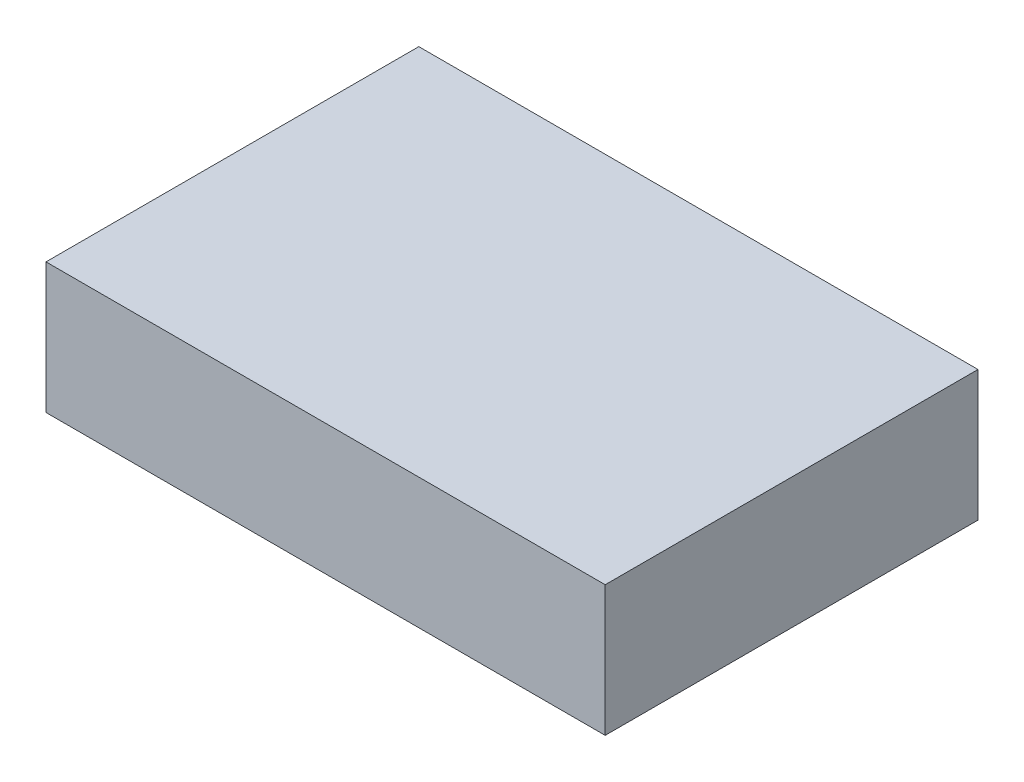
ISO-10303-21;
HEADER;
FILE_DESCRIPTION(('STEP AP214'),'2;1');
FILE_NAME('part.step','',(''),(''),'','','');
FILE_SCHEMA(('AUTOMOTIVE_DESIGN { 1 0 10303 214 1 1 1 1 }'));
ENDSEC;
DATA;
#1=APPLICATION_CONTEXT('core data for automotive mechanical design processes');
#2=APPLICATION_PROTOCOL_DEFINITION('international standard','automotive_design',2000,#1);
#3=PRODUCT_CONTEXT('',#1,'mechanical');
#4=PRODUCT('Part','Part','',(#3));
#5=PRODUCT_RELATED_PRODUCT_CATEGORY('part','',(#4));
#6=PRODUCT_DEFINITION_FORMATION('','',#4);
#7=PRODUCT_DEFINITION_CONTEXT('part definition',#1,'design');
#8=PRODUCT_DEFINITION('design','',#6,#7);
#9=PRODUCT_DEFINITION_SHAPE('','',#8);
#10=(LENGTH_UNIT() NAMED_UNIT(*) SI_UNIT(.MILLI.,.METRE.));
#11=(NAMED_UNIT(*) PLANE_ANGLE_UNIT() SI_UNIT($,.RADIAN.));
#12=(NAMED_UNIT(*) SI_UNIT($,.STERADIAN.) SOLID_ANGLE_UNIT());
#13=UNCERTAINTY_MEASURE_WITH_UNIT(LENGTH_MEASURE(1.E-05),#10,'distance_accuracy_value','');
#14=(GEOMETRIC_REPRESENTATION_CONTEXT(3) GLOBAL_UNCERTAINTY_ASSIGNED_CONTEXT((#13)) GLOBAL_UNIT_ASSIGNED_CONTEXT((#10,
#11,#12)) REPRESENTATION_CONTEXT('',''));
#15=CARTESIAN_POINT('',(0.,0.,0.));
#16=DIRECTION('',(0.,0.,1.));
#17=DIRECTION('',(1.,0.,0.));
#18=AXIS2_PLACEMENT_3D('',#15,#16,#17);
#19=CARTESIAN_POINT('',(0.381,-0.08889999999997,0.));
#20=DIRECTION('',(0.,-1.,0.));
#21=DIRECTION('',(0.,0.,-1.));
#22=AXIS2_PLACEMENT_3D('',#19,#20,#21);
#23=PLANE('',#22);
#24=DIRECTION('',(0.,0.,1.));
#25=VECTOR('',#24,1.);
#26=CARTESIAN_POINT('',(-0.381,-0.08889999999997,0.));
#27=LINE('',#26,#25);
#28=CARTESIAN_POINT('',(-0.380999365,-0.08889999999997,0.));
#29=VERTEX_POINT('',#28);
#30=CARTESIAN_POINT('',(-0.380999365,-0.08889999999997,0.508));
#31=VERTEX_POINT('',#30);
#32=EDGE_CURVE('E20',#29,#31,#27,.T.);
#33=ORIENTED_EDGE('',*,*,#32,.F.);
#34=DIRECTION('',(1.,0.,0.));
#35=VECTOR('',#34,1.);
#36=CARTESIAN_POINT('',(-0.381,-0.08889999999997,0.));
#37=LINE('',#36,#35);
#38=CARTESIAN_POINT('',(0.380999999999994,-0.08889999999997,0.));
#39=VERTEX_POINT('',#38);
#40=EDGE_CURVE('E79',#29,#39,#37,.T.);
#41=ORIENTED_EDGE('',*,*,#40,.T.);
#42=DIRECTION('',(0.,0.,1.));
#43=VECTOR('',#42,1.);
#44=CARTESIAN_POINT('',(0.380999999999975,-0.08889999999997,0.));
#45=LINE('',#44,#43);
#46=CARTESIAN_POINT('',(0.380999999999994,-0.08889999999997,0.508));
#47=VERTEX_POINT('',#46);
#48=EDGE_CURVE('E61',#47,#39,#45,.F.);
#49=ORIENTED_EDGE('',*,*,#48,.F.);
#50=DIRECTION('',(1.,0.,0.));
#51=VECTOR('',#50,1.);
#52=CARTESIAN_POINT('',(-0.381,-0.08889999999997,0.508));
#53=LINE('',#52,#51);
#54=EDGE_CURVE('E56',#31,#47,#53,.T.);
#55=ORIENTED_EDGE('',*,*,#54,.F.);
#56=EDGE_LOOP('',(#33,#41,#49,#55));
#57=FACE_BOUND('',#56,.T.);
#58=ADVANCED_FACE('F17',(#57),#23,.T.);
#59=CARTESIAN_POINT('',(-0.381,-0.08889999999997,0.));
#60=DIRECTION('',(-0.999999999897959,1.42857141075194E-05,0.));
#61=DIRECTION('',(-1.42857141075194E-05,-0.999999999897959,0.));
#62=AXIS2_PLACEMENT_3D('',#59,#60,#61);
#63=PLANE('',#62);
#64=DIRECTION('',(0.,0.,1.));
#65=VECTOR('',#64,1.);
#66=CARTESIAN_POINT('',(-0.38099746,0.08890000000002,0.));
#67=LINE('',#66,#65);
#68=CARTESIAN_POINT('',(-0.380997460000016,0.08890000000002,0.));
#69=VERTEX_POINT('',#68);
#70=CARTESIAN_POINT('',(-0.380997460000016,0.08890000000002,0.508));
#71=VERTEX_POINT('',#70);
#72=EDGE_CURVE('E83',#69,#71,#67,.T.);
#73=ORIENTED_EDGE('',*,*,#72,.F.);
#74=DIRECTION('',(0.,1.,0.));
#75=VECTOR('',#74,1.);
#76=CARTESIAN_POINT('',(-0.38099746,-0.08889999999997,0.));
#77=LINE('',#76,#75);
#78=EDGE_CURVE('E68',#69,#29,#77,.F.);
#79=ORIENTED_EDGE('',*,*,#78,.T.);
#80=ORIENTED_EDGE('',*,*,#32,.T.);
#81=DIRECTION('',(0.,1.,0.));
#82=VECTOR('',#81,1.);
#83=CARTESIAN_POINT('',(-0.38099746,-0.08889999999997,0.508));
#84=LINE('',#83,#82);
#85=EDGE_CURVE('E63',#71,#31,#84,.F.);
#86=ORIENTED_EDGE('',*,*,#85,.F.);
#87=EDGE_LOOP('',(#73,#79,#80,#86));
#88=FACE_BOUND('',#87,.T.);
#89=ADVANCED_FACE('F65',(#88),#63,.T.);
#90=CARTESIAN_POINT('',(-0.381,-0.08889999999997,0.508));
#91=DIRECTION('',(0.,0.,1.));
#92=DIRECTION('',(1.,0.,0.));
#93=AXIS2_PLACEMENT_3D('',#90,#91,#92);
#94=PLANE('',#93);
#95=DIRECTION('',(1.,0.,0.));
#96=VECTOR('',#95,1.);
#97=CARTESIAN_POINT('',(-0.38099746,0.08890000000002,0.508));
#98=LINE('',#97,#96);
#99=CARTESIAN_POINT('',(0.38100127,0.08890000000002,0.508));
#100=VERTEX_POINT('',#99);
#101=EDGE_CURVE('E72',#71,#100,#98,.T.);
#102=ORIENTED_EDGE('',*,*,#101,.F.);
#103=ORIENTED_EDGE('',*,*,#85,.T.);
#104=ORIENTED_EDGE('',*,*,#54,.T.);
#105=DIRECTION('',(1.42857144272194E-05,0.999999999897959,0.));
#106=VECTOR('',#105,1.);
#107=CARTESIAN_POINT('',(0.38100254,0.08890000000002,0.508));
#108=LINE('',#107,#106);
#109=EDGE_CURVE('E74',#100,#47,#108,.F.);
#110=ORIENTED_EDGE('',*,*,#109,.F.);
#111=EDGE_LOOP('',(#102,#103,#104,#110));
#112=FACE_BOUND('',#111,.T.);
#113=ADVANCED_FACE('F70',(#112),#94,.T.);
#114=CARTESIAN_POINT('',(0.38100254,0.08890000000002,0.));
#115=DIRECTION('',(0.999999999897959,-1.42857144272194E-05,0.));
#116=DIRECTION('',(1.42857144272194E-05,0.999999999897959,0.));
#117=AXIS2_PLACEMENT_3D('',#114,#115,#116);
#118=PLANE('',#117);
#119=ORIENTED_EDGE('',*,*,#48,.T.);
#120=DIRECTION('',(0.,1.,0.));
#121=VECTOR('',#120,1.);
#122=CARTESIAN_POINT('',(0.381,-0.08889999999997,0.));
#123=LINE('',#122,#121);
#124=CARTESIAN_POINT('',(0.381001905,0.08890000000002,0.));
#125=VERTEX_POINT('',#124);
#126=EDGE_CURVE('E35',#39,#125,#123,.T.);
#127=ORIENTED_EDGE('',*,*,#126,.T.);
#128=DIRECTION('',(0.,0.,1.));
#129=VECTOR('',#128,1.);
#130=CARTESIAN_POINT('',(0.38100254,0.08890000000002,0.));
#131=LINE('',#130,#129);
#132=EDGE_CURVE('E26',#100,#125,#131,.F.);
#133=ORIENTED_EDGE('',*,*,#132,.F.);
#134=ORIENTED_EDGE('',*,*,#109,.T.);
#135=EDGE_LOOP('',(#119,#127,#133,#134));
#136=FACE_BOUND('',#135,.T.);
#137=ADVANCED_FACE('F89',(#136),#118,.T.);
#138=CARTESIAN_POINT('',(-0.381,-0.08889999999997,0.));
#139=DIRECTION('',(0.,0.,1.));
#140=DIRECTION('',(1.,0.,0.));
#141=AXIS2_PLACEMENT_3D('',#138,#139,#140);
#142=PLANE('',#141);
#143=DIRECTION('',(1.,0.,0.));
#144=VECTOR('',#143,1.);
#145=CARTESIAN_POINT('',(-0.38099746,0.08890000000002,0.));
#146=LINE('',#145,#144);
#147=EDGE_CURVE('E11',#125,#69,#146,.F.);
#148=ORIENTED_EDGE('',*,*,#147,.F.);
#149=ORIENTED_EDGE('',*,*,#126,.F.);
#150=ORIENTED_EDGE('',*,*,#40,.F.);
#151=ORIENTED_EDGE('',*,*,#78,.F.);
#152=EDGE_LOOP('',(#148,#149,#150,#151));
#153=FACE_BOUND('',#152,.T.);
#154=ADVANCED_FACE('F91',(#153),#142,.F.);
#155=CARTESIAN_POINT('',(-0.38099746,0.08890000000002,0.));
#156=DIRECTION('',(0.,1.,0.));
#157=DIRECTION('',(0.,0.,1.));
#158=AXIS2_PLACEMENT_3D('',#155,#156,#157);
#159=PLANE('',#158);
#160=ORIENTED_EDGE('',*,*,#132,.T.);
#161=ORIENTED_EDGE('',*,*,#147,.T.);
#162=ORIENTED_EDGE('',*,*,#72,.T.);
#163=ORIENTED_EDGE('',*,*,#101,.T.);
#164=EDGE_LOOP('',(#160,#161,#162,#163));
#165=FACE_BOUND('',#164,.T.);
#166=ADVANCED_FACE('F88',(#165),#159,.T.);
#167=CLOSED_SHELL('',(#58,#89,#113,#137,#154,#166));
#168=MANIFOLD_SOLID_BREP('B1',#167);
#169=ADVANCED_BREP_SHAPE_REPRESENTATION('',(#18,#168),#14);
#170=SHAPE_DEFINITION_REPRESENTATION(#9,#169);
ENDSEC;
END-ISO-10303-21;
